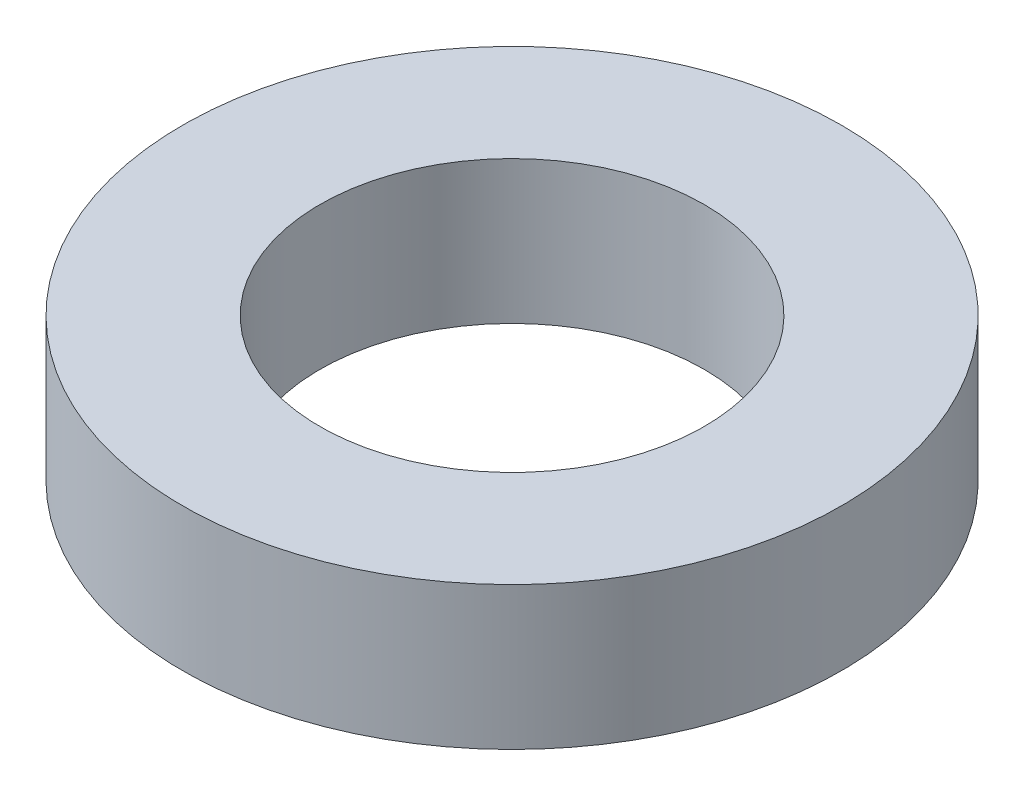
ISO-10303-21;
HEADER;
FILE_DESCRIPTION(('STEP AP214'),'2;1');
FILE_NAME('part.step','',(''),(''),'','','');
FILE_SCHEMA(('AUTOMOTIVE_DESIGN { 1 0 10303 214 1 1 1 1 }'));
ENDSEC;
DATA;
#1=APPLICATION_CONTEXT('core data for automotive mechanical design processes');
#2=APPLICATION_PROTOCOL_DEFINITION('international standard','automotive_design',2000,#1);
#3=PRODUCT_CONTEXT('',#1,'mechanical');
#4=PRODUCT('Part','Part','',(#3));
#5=PRODUCT_RELATED_PRODUCT_CATEGORY('part','',(#4));
#6=PRODUCT_DEFINITION_FORMATION('','',#4);
#7=PRODUCT_DEFINITION_CONTEXT('part definition',#1,'design');
#8=PRODUCT_DEFINITION('design','',#6,#7);
#9=PRODUCT_DEFINITION_SHAPE('','',#8);
#10=(LENGTH_UNIT() NAMED_UNIT(*) SI_UNIT(.MILLI.,.METRE.));
#11=(NAMED_UNIT(*) PLANE_ANGLE_UNIT() SI_UNIT($,.RADIAN.));
#12=(NAMED_UNIT(*) SI_UNIT($,.STERADIAN.) SOLID_ANGLE_UNIT());
#13=UNCERTAINTY_MEASURE_WITH_UNIT(LENGTH_MEASURE(1.E-05),#10,'distance_accuracy_value','');
#14=(GEOMETRIC_REPRESENTATION_CONTEXT(3) GLOBAL_UNCERTAINTY_ASSIGNED_CONTEXT((#13)) GLOBAL_UNIT_ASSIGNED_CONTEXT((#10,
#11,#12)) REPRESENTATION_CONTEXT('',''));
#15=CARTESIAN_POINT('',(0.,0.,0.));
#16=DIRECTION('',(0.,0.,1.));
#17=DIRECTION('',(1.,0.,0.));
#18=AXIS2_PLACEMENT_3D('',#15,#16,#17);
#19=CARTESIAN_POINT('',(0.,13.,0.));
#20=DIRECTION('',(0.,-1.,0.));
#21=DIRECTION('',(0.,0.,-1.));
#22=AXIS2_PLACEMENT_3D('',#19,#20,#21);
#23=CYLINDRICAL_SURFACE('',#22,30.);
#24=CARTESIAN_POINT('',(0.,13.,0.));
#25=DIRECTION('',(0.,1.,0.));
#26=DIRECTION('',(0.,0.,1.));
#27=AXIS2_PLACEMENT_3D('',#24,#25,#26);
#28=CIRCLE('',#27,30.);
#29=CARTESIAN_POINT('',(0.,13.,-30.));
#30=VERTEX_POINT('',#29);
#31=EDGE_CURVE('E10',#30,#30,#28,.T.);
#32=CARTESIAN_POINT('',(0.,0.,0.));
#33=DIRECTION('',(0.,1.,0.));
#34=DIRECTION('',(0.,0.,1.));
#35=AXIS2_PLACEMENT_3D('',#32,#33,#34);
#36=CIRCLE('',#35,30.);
#37=CARTESIAN_POINT('',(0.,0.,-30.));
#38=VERTEX_POINT('',#37);
#39=EDGE_CURVE('E37',#38,#38,#36,.T.);
#40=CARTESIAN_POINT('',(0.,13.,-30.));
#41=CARTESIAN_POINT('',(0.,12.8645833333333,-30.));
#42=CARTESIAN_POINT('',(0.,12.7291666666667,-30.));
#43=CARTESIAN_POINT('',(0.,12.4583333333333,-30.));
#44=CARTESIAN_POINT('',(0.,12.3229166666667,-30.));
#45=CARTESIAN_POINT('',(0.,12.0520833333333,-30.));
#46=CARTESIAN_POINT('',(0.,11.9166666666667,-30.));
#47=CARTESIAN_POINT('',(0.,11.6458333333333,-30.));
#48=CARTESIAN_POINT('',(0.,11.5104166666667,-30.));
#49=CARTESIAN_POINT('',(0.,11.2395833333333,-30.));
#50=CARTESIAN_POINT('',(0.,11.1041666666667,-30.));
#51=CARTESIAN_POINT('',(0.,10.8333333333333,-30.));
#52=CARTESIAN_POINT('',(0.,10.6979166666667,-30.));
#53=CARTESIAN_POINT('',(0.,10.4270833333333,-30.));
#54=CARTESIAN_POINT('',(0.,10.2916666666667,-30.));
#55=CARTESIAN_POINT('',(0.,10.0208333333333,-30.));
#56=CARTESIAN_POINT('',(0.,9.88541666666667,-30.));
#57=CARTESIAN_POINT('',(0.,9.61458333333333,-30.));
#58=CARTESIAN_POINT('',(0.,9.47916666666667,-30.));
#59=CARTESIAN_POINT('',(0.,9.20833333333333,-30.));
#60=CARTESIAN_POINT('',(0.,9.07291666666667,-30.));
#61=CARTESIAN_POINT('',(0.,8.80208333333333,-30.));
#62=CARTESIAN_POINT('',(0.,8.66666666666667,-30.));
#63=CARTESIAN_POINT('',(0.,8.39583333333333,-30.));
#64=CARTESIAN_POINT('',(0.,8.26041666666667,-30.));
#65=CARTESIAN_POINT('',(0.,7.98958333333333,-30.));
#66=CARTESIAN_POINT('',(0.,7.85416666666667,-30.));
#67=CARTESIAN_POINT('',(0.,7.58333333333333,-30.));
#68=CARTESIAN_POINT('',(0.,7.44791666666667,-30.));
#69=CARTESIAN_POINT('',(0.,7.17708333333333,-30.));
#70=CARTESIAN_POINT('',(0.,7.04166666666667,-30.));
#71=CARTESIAN_POINT('',(0.,6.77083333333333,-30.));
#72=CARTESIAN_POINT('',(0.,6.63541666666667,-30.));
#73=CARTESIAN_POINT('',(0.,6.36458333333333,-30.));
#74=CARTESIAN_POINT('',(0.,6.22916666666667,-30.));
#75=CARTESIAN_POINT('',(0.,5.95833333333333,-30.));
#76=CARTESIAN_POINT('',(0.,5.82291666666667,-30.));
#77=CARTESIAN_POINT('',(0.,5.55208333333333,-30.));
#78=CARTESIAN_POINT('',(0.,5.41666666666667,-30.));
#79=CARTESIAN_POINT('',(0.,5.14583333333333,-30.));
#80=CARTESIAN_POINT('',(0.,5.01041666666667,-30.));
#81=CARTESIAN_POINT('',(0.,4.73958333333333,-30.));
#82=CARTESIAN_POINT('',(0.,4.60416666666667,-30.));
#83=CARTESIAN_POINT('',(0.,4.33333333333333,-30.));
#84=CARTESIAN_POINT('',(0.,4.19791666666667,-30.));
#85=CARTESIAN_POINT('',(0.,3.92708333333333,-30.));
#86=CARTESIAN_POINT('',(0.,3.79166666666667,-30.));
#87=CARTESIAN_POINT('',(0.,3.52083333333333,-30.));
#88=CARTESIAN_POINT('',(0.,3.38541666666667,-30.));
#89=CARTESIAN_POINT('',(0.,3.11458333333333,-30.));
#90=CARTESIAN_POINT('',(0.,2.97916666666667,-30.));
#91=CARTESIAN_POINT('',(0.,2.70833333333333,-30.));
#92=CARTESIAN_POINT('',(0.,2.57291666666667,-30.));
#93=CARTESIAN_POINT('',(0.,2.30208333333333,-30.));
#94=CARTESIAN_POINT('',(0.,2.16666666666667,-30.));
#95=CARTESIAN_POINT('',(0.,1.89583333333333,-30.));
#96=CARTESIAN_POINT('',(0.,1.76041666666667,-30.));
#97=CARTESIAN_POINT('',(0.,1.48958333333333,-30.));
#98=CARTESIAN_POINT('',(0.,1.35416666666667,-30.));
#99=CARTESIAN_POINT('',(0.,1.08333333333333,-30.));
#100=CARTESIAN_POINT('',(0.,0.947916666666667,-30.));
#101=CARTESIAN_POINT('',(0.,0.677083333333334,-30.));
#102=CARTESIAN_POINT('',(0.,0.541666666666667,-30.));
#103=CARTESIAN_POINT('',(0.,0.270833333333334,-30.));
#104=CARTESIAN_POINT('',(0.,0.135416666666667,-30.));
#105=CARTESIAN_POINT('',(0.,0.,-30.));
#106=B_SPLINE_CURVE_WITH_KNOTS('',3,(#40,#41,#42,#43,#44,#45,#46,#47,#48,#49,#50,#51,#52,#53,
#54,#55,#56,#57,#58,#59,#60,#61,#62,#63,#64,#65,#66,#67,#68,#69,#70,#71,#72,#73,#74,#75,#76,#77,
#78,#79,#80,#81,#82,#83,#84,#85,#86,#87,#88,#89,#90,#91,#92,#93,#94,#95,#96,#97,#98,#99,#100,
#101,#102,#103,#104,#105),.UNSPECIFIED.,.F.,.F.,(4,2,2,2,2,2,2,2,2,2,2,2,2,2,2,2,2,2,2,2,2,2,2,
2,2,2,2,2,2,2,2,2,4),(0.,0.406249999999999,0.812499999999999,1.21875,1.625,2.03125,2.4375,
2.84375,3.25,3.65625,4.0625,4.46875,4.875,5.28125,5.6875,6.09375,6.5,6.90625,7.3125,7.71875,
8.125,8.53125,8.9375,9.34375,9.75,10.15625,10.5625,10.96875,11.375,11.78125,12.1875,12.59375,
13.),.UNSPECIFIED.);
#107=EDGE_CURVE('BSEAM40',#30,#38,#106,.T.);
#108=ORIENTED_EDGE('',*,*,#31,.F.);
#109=ORIENTED_EDGE('',*,*,#39,.T.);
#110=ORIENTED_EDGE('',*,*,#107,.T.);
#111=ORIENTED_EDGE('',*,*,#107,.F.);
#112=EDGE_LOOP('',(#108,#110,#109,#111));
#113=FACE_BOUND('',#112,.T.);
#114=ADVANCED_FACE('F40',(#113),#23,.T.);
#115=CARTESIAN_POINT('',(0.,13.,0.));
#116=DIRECTION('',(0.,1.,0.));
#117=DIRECTION('',(0.,0.,1.));
#118=AXIS2_PLACEMENT_3D('',#115,#116,#117);
#119=PLANE('',#118);
#120=CARTESIAN_POINT('',(0.,13.,0.));
#121=DIRECTION('',(0.,1.,0.));
#122=DIRECTION('',(0.,0.,1.));
#123=AXIS2_PLACEMENT_3D('',#120,#121,#122);
#124=CIRCLE('',#123,17.5);
#125=CARTESIAN_POINT('',(0.,13.,-17.5));
#126=VERTEX_POINT('',#125);
#127=EDGE_CURVE('E50',#126,#126,#124,.T.);
#128=ORIENTED_EDGE('',*,*,#127,.F.);
#129=EDGE_LOOP('',(#128));
#130=FACE_BOUND('',#129,.T.);
#131=ORIENTED_EDGE('',*,*,#31,.T.);
#132=EDGE_LOOP('',(#131));
#133=FACE_BOUND('',#132,.T.);
#134=ADVANCED_FACE('F59',(#130,#133),#119,.T.);
#135=CARTESIAN_POINT('',(0.,0.,0.));
#136=DIRECTION('',(0.,1.,0.));
#137=DIRECTION('',(0.,0.,1.));
#138=AXIS2_PLACEMENT_3D('',#135,#136,#137);
#139=PLANE('',#138);
#140=CARTESIAN_POINT('',(0.,0.,0.));
#141=DIRECTION('',(0.,1.,0.));
#142=DIRECTION('',(0.,0.,1.));
#143=AXIS2_PLACEMENT_3D('',#140,#141,#142);
#144=CIRCLE('',#143,17.5);
#145=CARTESIAN_POINT('',(0.,0.,-17.5));
#146=VERTEX_POINT('',#145);
#147=EDGE_CURVE('E47',#146,#146,#144,.T.);
#148=ORIENTED_EDGE('',*,*,#147,.T.);
#149=EDGE_LOOP('',(#148));
#150=FACE_BOUND('',#149,.T.);
#151=ORIENTED_EDGE('',*,*,#39,.F.);
#152=EDGE_LOOP('',(#151));
#153=FACE_BOUND('',#152,.T.);
#154=ADVANCED_FACE('F58',(#150,#153),#139,.F.);
#155=CARTESIAN_POINT('',(0.,13.,0.));
#156=DIRECTION('',(0.,-1.,0.));
#157=DIRECTION('',(0.,0.,-1.));
#158=AXIS2_PLACEMENT_3D('',#155,#156,#157);
#159=CYLINDRICAL_SURFACE('',#158,17.5);
#160=CARTESIAN_POINT('',(0.,13.,-17.5));
#161=CARTESIAN_POINT('',(0.,12.8645833333333,-17.5));
#162=CARTESIAN_POINT('',(0.,12.7291666666667,-17.5));
#163=CARTESIAN_POINT('',(0.,12.4583333333333,-17.5));
#164=CARTESIAN_POINT('',(0.,12.3229166666667,-17.5));
#165=CARTESIAN_POINT('',(0.,12.0520833333333,-17.5));
#166=CARTESIAN_POINT('',(0.,11.9166666666667,-17.5));
#167=CARTESIAN_POINT('',(0.,11.6458333333333,-17.5));
#168=CARTESIAN_POINT('',(0.,11.5104166666667,-17.5));
#169=CARTESIAN_POINT('',(0.,11.2395833333333,-17.5));
#170=CARTESIAN_POINT('',(0.,11.1041666666667,-17.5));
#171=CARTESIAN_POINT('',(0.,10.8333333333333,-17.5));
#172=CARTESIAN_POINT('',(0.,10.6979166666667,-17.5));
#173=CARTESIAN_POINT('',(0.,10.4270833333333,-17.5));
#174=CARTESIAN_POINT('',(0.,10.2916666666667,-17.5));
#175=CARTESIAN_POINT('',(0.,10.0208333333333,-17.5));
#176=CARTESIAN_POINT('',(0.,9.88541666666667,-17.5));
#177=CARTESIAN_POINT('',(0.,9.61458333333333,-17.5));
#178=CARTESIAN_POINT('',(0.,9.47916666666667,-17.5));
#179=CARTESIAN_POINT('',(0.,9.20833333333333,-17.5));
#180=CARTESIAN_POINT('',(0.,9.07291666666667,-17.5));
#181=CARTESIAN_POINT('',(0.,8.80208333333333,-17.5));
#182=CARTESIAN_POINT('',(0.,8.66666666666667,-17.5));
#183=CARTESIAN_POINT('',(0.,8.39583333333333,-17.5));
#184=CARTESIAN_POINT('',(0.,8.26041666666667,-17.5));
#185=CARTESIAN_POINT('',(0.,7.98958333333333,-17.5));
#186=CARTESIAN_POINT('',(0.,7.85416666666667,-17.5));
#187=CARTESIAN_POINT('',(0.,7.58333333333333,-17.5));
#188=CARTESIAN_POINT('',(0.,7.44791666666667,-17.5));
#189=CARTESIAN_POINT('',(0.,7.17708333333333,-17.5));
#190=CARTESIAN_POINT('',(0.,7.04166666666667,-17.5));
#191=CARTESIAN_POINT('',(0.,6.77083333333333,-17.5));
#192=CARTESIAN_POINT('',(0.,6.63541666666667,-17.5));
#193=CARTESIAN_POINT('',(0.,6.36458333333333,-17.5));
#194=CARTESIAN_POINT('',(0.,6.22916666666667,-17.5));
#195=CARTESIAN_POINT('',(0.,5.95833333333333,-17.5));
#196=CARTESIAN_POINT('',(0.,5.82291666666667,-17.5));
#197=CARTESIAN_POINT('',(0.,5.55208333333333,-17.5));
#198=CARTESIAN_POINT('',(0.,5.41666666666667,-17.5));
#199=CARTESIAN_POINT('',(0.,5.14583333333333,-17.5));
#200=CARTESIAN_POINT('',(0.,5.01041666666667,-17.5));
#201=CARTESIAN_POINT('',(0.,4.73958333333333,-17.5));
#202=CARTESIAN_POINT('',(0.,4.60416666666667,-17.5));
#203=CARTESIAN_POINT('',(0.,4.33333333333333,-17.5));
#204=CARTESIAN_POINT('',(0.,4.19791666666667,-17.5));
#205=CARTESIAN_POINT('',(0.,3.92708333333333,-17.5));
#206=CARTESIAN_POINT('',(0.,3.79166666666667,-17.5));
#207=CARTESIAN_POINT('',(0.,3.52083333333333,-17.5));
#208=CARTESIAN_POINT('',(0.,3.38541666666667,-17.5));
#209=CARTESIAN_POINT('',(0.,3.11458333333333,-17.5));
#210=CARTESIAN_POINT('',(0.,2.97916666666667,-17.5));
#211=CARTESIAN_POINT('',(0.,2.70833333333333,-17.5));
#212=CARTESIAN_POINT('',(0.,2.57291666666667,-17.5));
#213=CARTESIAN_POINT('',(0.,2.30208333333333,-17.5));
#214=CARTESIAN_POINT('',(0.,2.16666666666667,-17.5));
#215=CARTESIAN_POINT('',(0.,1.89583333333333,-17.5));
#216=CARTESIAN_POINT('',(0.,1.76041666666667,-17.5));
#217=CARTESIAN_POINT('',(0.,1.48958333333333,-17.5));
#218=CARTESIAN_POINT('',(0.,1.35416666666667,-17.5));
#219=CARTESIAN_POINT('',(0.,1.08333333333333,-17.5));
#220=CARTESIAN_POINT('',(0.,0.947916666666667,-17.5));
#221=CARTESIAN_POINT('',(0.,0.677083333333334,-17.5));
#222=CARTESIAN_POINT('',(0.,0.541666666666667,-17.5));
#223=CARTESIAN_POINT('',(0.,0.270833333333334,-17.5));
#224=CARTESIAN_POINT('',(0.,0.135416666666667,-17.5));
#225=CARTESIAN_POINT('',(0.,0.,-17.5));
#226=B_SPLINE_CURVE_WITH_KNOTS('',3,(#160,#161,#162,#163,#164,#165,#166,#167,#168,#169,#170,
#171,#172,#173,#174,#175,#176,#177,#178,#179,#180,#181,#182,#183,#184,#185,#186,#187,#188,#189,
#190,#191,#192,#193,#194,#195,#196,#197,#198,#199,#200,#201,#202,#203,#204,#205,#206,#207,#208,
#209,#210,#211,#212,#213,#214,#215,#216,#217,#218,#219,#220,#221,#222,#223,#224,#225),
.UNSPECIFIED.,.F.,.F.,(4,2,2,2,2,2,2,2,2,2,2,2,2,2,2,2,2,2,2,2,2,2,2,2,2,2,2,2,2,2,2,2,4),(0.,
0.406249999999999,0.812499999999999,1.21875,1.625,2.03125,2.4375,2.84375,3.25,3.65625,4.0625,
4.46875,4.875,5.28125,5.6875,6.09375,6.5,6.90625,7.3125,7.71875,8.125,8.53125,8.9375,9.34375,
9.75,10.15625,10.5625,10.96875,11.375,11.78125,12.1875,12.59375,13.),.UNSPECIFIED.);
#227=EDGE_CURVE('BSEAM54',#126,#146,#226,.T.);
#228=ORIENTED_EDGE('',*,*,#127,.T.);
#229=ORIENTED_EDGE('',*,*,#147,.F.);
#230=ORIENTED_EDGE('',*,*,#227,.T.);
#231=ORIENTED_EDGE('',*,*,#227,.F.);
#232=EDGE_LOOP('',(#228,#230,#229,#231));
#233=FACE_BOUND('',#232,.T.);
#234=ADVANCED_FACE('F54',(#233),#159,.F.);
#235=CLOSED_SHELL('',(#114,#134,#154,#234));
#236=MANIFOLD_SOLID_BREP('B2',#235);
#237=ADVANCED_BREP_SHAPE_REPRESENTATION('',(#18,#236),#14);
#238=SHAPE_DEFINITION_REPRESENTATION(#9,#237);
ENDSEC;
END-ISO-10303-21;
